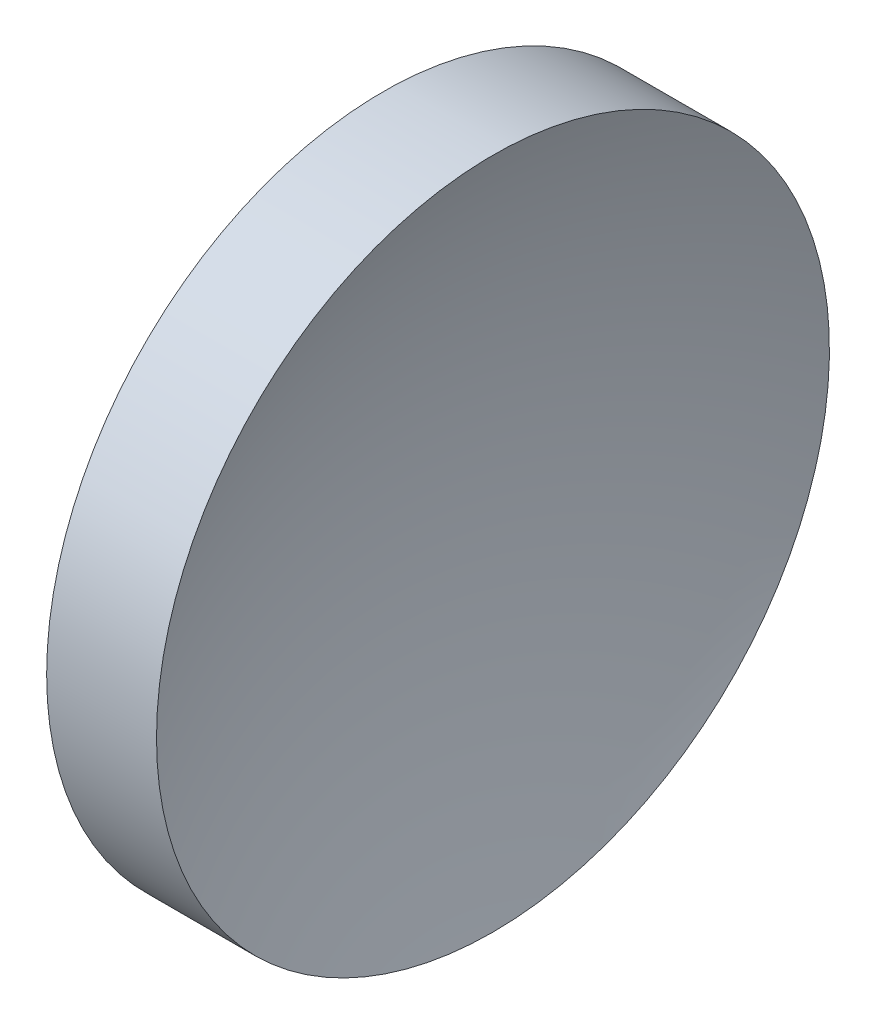
ISO-10303-21;
HEADER;
FILE_DESCRIPTION(('STEP AP214'),'2;1');
FILE_NAME('part.step','',(''),(''),'','','');
FILE_SCHEMA(('AUTOMOTIVE_DESIGN { 1 0 10303 214 1 1 1 1 }'));
ENDSEC;
DATA;
#1=APPLICATION_CONTEXT('core data for automotive mechanical design processes');
#2=APPLICATION_PROTOCOL_DEFINITION('international standard','automotive_design',2000,#1);
#3=PRODUCT_CONTEXT('',#1,'mechanical');
#4=PRODUCT('Part','Part','',(#3));
#5=PRODUCT_RELATED_PRODUCT_CATEGORY('part','',(#4));
#6=PRODUCT_DEFINITION_FORMATION('','',#4);
#7=PRODUCT_DEFINITION_CONTEXT('part definition',#1,'design');
#8=PRODUCT_DEFINITION('design','',#6,#7);
#9=PRODUCT_DEFINITION_SHAPE('','',#8);
#10=(LENGTH_UNIT() NAMED_UNIT(*) SI_UNIT(.MILLI.,.METRE.));
#11=(NAMED_UNIT(*) PLANE_ANGLE_UNIT() SI_UNIT($,.RADIAN.));
#12=(NAMED_UNIT(*) SI_UNIT($,.STERADIAN.) SOLID_ANGLE_UNIT());
#13=UNCERTAINTY_MEASURE_WITH_UNIT(LENGTH_MEASURE(1.E-05),#10,'distance_accuracy_value','');
#14=(GEOMETRIC_REPRESENTATION_CONTEXT(3) GLOBAL_UNCERTAINTY_ASSIGNED_CONTEXT((#13)) GLOBAL_UNIT_ASSIGNED_CONTEXT((#10,
#11,#12)) REPRESENTATION_CONTEXT('',''));
#15=CARTESIAN_POINT('',(0.,0.,0.));
#16=DIRECTION('',(0.,0.,1.));
#17=DIRECTION('',(1.,0.,0.));
#18=AXIS2_PLACEMENT_3D('',#15,#16,#17);
#19=CARTESIAN_POINT('',(168.05193167416,65.1556304570152,0.));
#20=DIRECTION('',(-1.,0.,0.));
#21=DIRECTION('',(0.,-1.,0.));
#22=AXIS2_PLACEMENT_3D('',#19,#20,#21);
#23=SPHERICAL_SURFACE('',#22,51.64);
#24=CARTESIAN_POINT('',(120.442167969642,65.1556304570152,0.));
#25=DIRECTION('',(-1.,0.,0.));
#26=DIRECTION('',(0.,0.,1.));
#27=AXIS2_PLACEMENT_3D('',#24,#25,#26);
#28=CIRCLE('',#27,20.);
#29=CARTESIAN_POINT('',(120.442167969642,65.1556304570152,20.));
#30=VERTEX_POINT('',#29);
#31=EDGE_CURVE('E10',#30,#30,#28,.T.);
#32=ORIENTED_EDGE('',*,*,#31,.F.);
#33=EDGE_LOOP('',(#32));
#34=FACE_BOUND('',#33,.T.);
#35=ADVANCED_FACE('F35',(#34),#23,.F.);
#36=CARTESIAN_POINT('',(105.62183712383,65.1556304570152,0.));
#37=DIRECTION('',(-1.,0.,0.));
#38=DIRECTION('',(0.,0.,1.));
#39=AXIS2_PLACEMENT_3D('',#36,#37,#38);
#40=CYLINDRICAL_SURFACE('',#39,20.);
#41=CARTESIAN_POINT('',(113.91193167416,65.1556304570152,0.));
#42=DIRECTION('',(-1.,0.,0.));
#43=DIRECTION('',(0.,0.,1.));
#44=AXIS2_PLACEMENT_3D('',#41,#42,#43);
#45=CIRCLE('',#44,20.);
#46=CARTESIAN_POINT('',(113.91193167416,65.1556304570152,20.));
#47=VERTEX_POINT('',#46);
#48=EDGE_CURVE('E41',#47,#47,#45,.T.);
#49=ORIENTED_EDGE('',*,*,#48,.F.);
#50=EDGE_LOOP('',(#49));
#51=FACE_BOUND('',#50,.T.);
#52=ORIENTED_EDGE('',*,*,#31,.T.);
#53=EDGE_LOOP('',(#52));
#54=FACE_BOUND('',#53,.T.);
#55=ADVANCED_FACE('F49',(#51,#54),#40,.T.);
#56=CARTESIAN_POINT('',(113.91193167416,65.1556304570152,0.));
#57=DIRECTION('',(1.,0.,0.));
#58=DIRECTION('',(0.,0.,-1.));
#59=AXIS2_PLACEMENT_3D('',#56,#57,#58);
#60=PLANE('',#59);
#61=ORIENTED_EDGE('',*,*,#48,.T.);
#62=EDGE_LOOP('',(#61));
#63=FACE_BOUND('',#62,.T.);
#64=ADVANCED_FACE('F47',(#63),#60,.F.);
#65=CLOSED_SHELL('',(#35,#55,#64));
#66=MANIFOLD_SOLID_BREP('B2',#65);
#67=ADVANCED_BREP_SHAPE_REPRESENTATION('',(#18,#66),#14);
#68=SHAPE_DEFINITION_REPRESENTATION(#9,#67);
ENDSEC;
END-ISO-10303-21;
